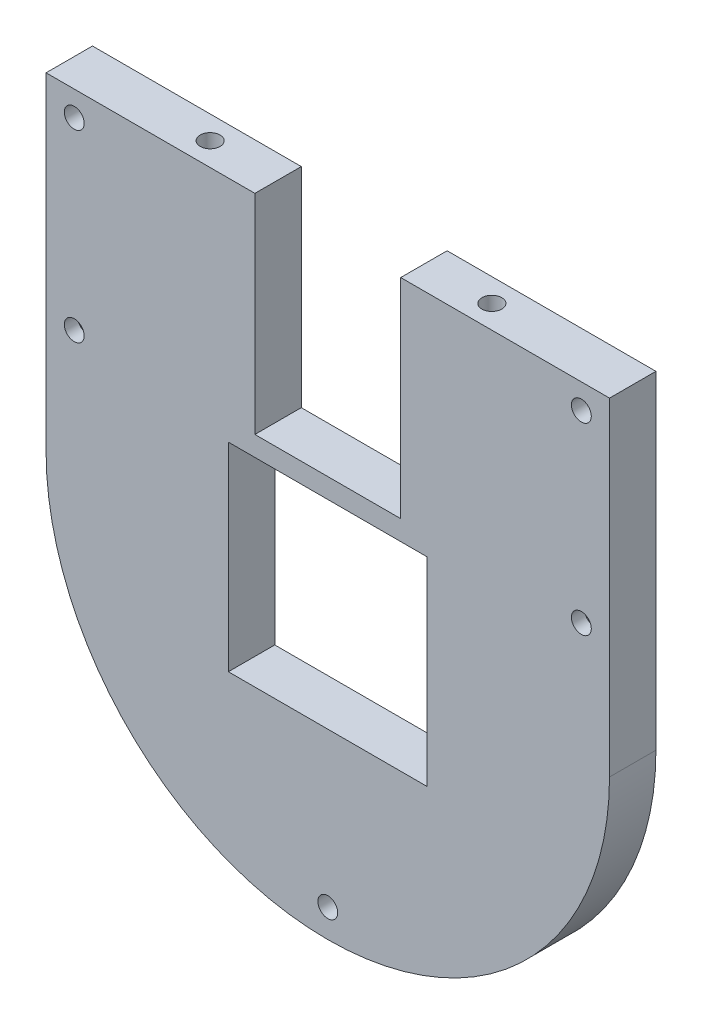
ISO-10303-21;
HEADER;
FILE_DESCRIPTION(('STEP AP214'),'2;1');
FILE_NAME('part.step','',(''),(''),'','','');
FILE_SCHEMA(('AUTOMOTIVE_DESIGN { 1 0 10303 214 1 1 1 1 }'));
ENDSEC;
DATA;
#1=APPLICATION_CONTEXT('core data for automotive mechanical design processes');
#2=APPLICATION_PROTOCOL_DEFINITION('international standard','automotive_design',2000,#1);
#3=PRODUCT_CONTEXT('',#1,'mechanical');
#4=PRODUCT('Part','Part','',(#3));
#5=PRODUCT_RELATED_PRODUCT_CATEGORY('part','',(#4));
#6=PRODUCT_DEFINITION_FORMATION('','',#4);
#7=PRODUCT_DEFINITION_CONTEXT('part definition',#1,'design');
#8=PRODUCT_DEFINITION('design','',#6,#7);
#9=PRODUCT_DEFINITION_SHAPE('','',#8);
#10=(LENGTH_UNIT() NAMED_UNIT(*) SI_UNIT(.MILLI.,.METRE.));
#11=(NAMED_UNIT(*) PLANE_ANGLE_UNIT() SI_UNIT($,.RADIAN.));
#12=(NAMED_UNIT(*) SI_UNIT($,.STERADIAN.) SOLID_ANGLE_UNIT());
#13=UNCERTAINTY_MEASURE_WITH_UNIT(LENGTH_MEASURE(1.E-05),#10,'distance_accuracy_value','');
#14=(GEOMETRIC_REPRESENTATION_CONTEXT(3) GLOBAL_UNCERTAINTY_ASSIGNED_CONTEXT((#13)) GLOBAL_UNIT_ASSIGNED_CONTEXT((#10,
#11,#12)) REPRESENTATION_CONTEXT('',''));
#15=CARTESIAN_POINT('',(0.,0.,0.));
#16=DIRECTION('',(0.,0.,1.));
#17=DIRECTION('',(1.,0.,0.));
#18=AXIS2_PLACEMENT_3D('',#15,#16,#17);
#19=CARTESIAN_POINT('',(0.,0.,7.));
#20=DIRECTION('',(0.,0.,-1.));
#21=DIRECTION('',(-1.,0.,0.));
#22=AXIS2_PLACEMENT_3D('',#19,#20,#21);
#23=PLANE('',#22);
#24=DIRECTION('',(-1.,0.,0.));
#25=VECTOR('',#24,1.);
#26=CARTESIAN_POINT('',(27.5,60.,7.));
#27=LINE('',#26,#25);
#28=CARTESIAN_POINT('',(57.5,60.,7.));
#29=VERTEX_POINT('',#28);
#30=CARTESIAN_POINT('',(27.5,60.,7.));
#31=VERTEX_POINT('',#30);
#32=EDGE_CURVE('E407',#29,#31,#27,.T.);
#33=ORIENTED_EDGE('',*,*,#32,.F.);
#34=DIRECTION('',(0.,1.,0.));
#35=VECTOR('',#34,1.);
#36=CARTESIAN_POINT('',(57.5,30.,7.));
#37=LINE('',#36,#35);
#38=CARTESIAN_POINT('',(57.5,30.,7.));
#39=VERTEX_POINT('',#38);
#40=EDGE_CURVE('E384',#39,#29,#37,.T.);
#41=ORIENTED_EDGE('',*,*,#40,.F.);
#42=DIRECTION('',(1.,0.,0.));
#43=VECTOR('',#42,1.);
#44=CARTESIAN_POINT('',(27.5,30.,7.));
#45=LINE('',#44,#43);
#46=CARTESIAN_POINT('',(27.5,30.,7.));
#47=VERTEX_POINT('',#46);
#48=EDGE_CURVE('E393',#47,#39,#45,.T.);
#49=ORIENTED_EDGE('',*,*,#48,.F.);
#50=DIRECTION('',(0.,-1.,0.));
#51=VECTOR('',#50,1.);
#52=CARTESIAN_POINT('',(27.5,30.,7.));
#53=LINE('',#52,#51);
#54=EDGE_CURVE('E411',#31,#47,#53,.T.);
#55=ORIENTED_EDGE('',*,*,#54,.F.);
#56=EDGE_LOOP('',(#33,#41,#49,#55));
#57=FACE_BOUND('',#56,.T.);
#58=CARTESIAN_POINT('',(80.75,90.75,7.));
#59=DIRECTION('',(0.,0.,-1.));
#60=DIRECTION('',(-1.,0.,0.));
#61=AXIS2_PLACEMENT_3D('',#58,#59,#60);
#62=CIRCLE('',#61,1.5);
#63=CARTESIAN_POINT('',(79.25,90.75,7.));
#64=VERTEX_POINT('',#63);
#65=EDGE_CURVE('E371',#64,#64,#62,.T.);
#66=ORIENTED_EDGE('',*,*,#65,.T.);
#67=EDGE_LOOP('',(#66));
#68=FACE_BOUND('',#67,.T.);
#69=CARTESIAN_POINT('',(4.24999999999999,90.75,7.));
#70=DIRECTION('',(0.,0.,-1.));
#71=DIRECTION('',(-1.,0.,0.));
#72=AXIS2_PLACEMENT_3D('',#69,#70,#71);
#73=CIRCLE('',#72,1.5);
#74=CARTESIAN_POINT('',(2.74999999999999,90.75,7.));
#75=VERTEX_POINT('',#74);
#76=EDGE_CURVE('E375',#75,#75,#73,.T.);
#77=ORIENTED_EDGE('',*,*,#76,.T.);
#78=EDGE_LOOP('',(#77));
#79=FACE_BOUND('',#78,.T.);
#80=CARTESIAN_POINT('',(4.24999999999999,63.,7.));
#81=DIRECTION('',(0.,0.,1.));
#82=DIRECTION('',(-1.,0.,0.));
#83=AXIS2_PLACEMENT_3D('',#80,#81,#82);
#84=CIRCLE('',#83,1.5);
#85=CARTESIAN_POINT('',(2.74999999999999,63.,7.));
#86=VERTEX_POINT('',#85);
#87=EDGE_CURVE('E250',#86,#86,#84,.T.);
#88=ORIENTED_EDGE('',*,*,#87,.F.);
#89=EDGE_LOOP('',(#88));
#90=FACE_BOUND('',#89,.T.);
#91=CARTESIAN_POINT('',(80.75,63.,7.));
#92=DIRECTION('',(0.,0.,1.));
#93=DIRECTION('',(1.,0.,0.));
#94=AXIS2_PLACEMENT_3D('',#91,#92,#93);
#95=CIRCLE('',#94,1.5);
#96=CARTESIAN_POINT('',(82.25,63.,7.));
#97=VERTEX_POINT('',#96);
#98=EDGE_CURVE('E344',#97,#97,#95,.T.);
#99=ORIENTED_EDGE('',*,*,#98,.F.);
#100=EDGE_LOOP('',(#99));
#101=FACE_BOUND('',#100,.T.);
#102=CARTESIAN_POINT('',(42.5,6.75,7.));
#103=DIRECTION('',(0.,0.,1.));
#104=DIRECTION('',(1.,0.,0.));
#105=AXIS2_PLACEMENT_3D('',#102,#103,#104);
#106=CIRCLE('',#105,1.5);
#107=CARTESIAN_POINT('',(44.,6.75,7.));
#108=VERTEX_POINT('',#107);
#109=EDGE_CURVE('E527',#108,#108,#106,.T.);
#110=ORIENTED_EDGE('',*,*,#109,.F.);
#111=EDGE_LOOP('',(#110));
#112=FACE_BOUND('',#111,.T.);
#113=DIRECTION('',(1.,0.,0.));
#114=VECTOR('',#113,1.);
#115=CARTESIAN_POINT('',(0.,94.5,7.));
#116=LINE('',#115,#114);
#117=CARTESIAN_POINT('',(0.,94.5,7.));
#118=VERTEX_POINT('',#117);
#119=CARTESIAN_POINT('',(31.5,94.5,7.));
#120=VERTEX_POINT('',#119);
#121=EDGE_CURVE('E62',#118,#120,#116,.T.);
#122=ORIENTED_EDGE('',*,*,#121,.F.);
#123=DIRECTION('',(0.,-1.,0.));
#124=VECTOR('',#123,1.);
#125=CARTESIAN_POINT('',(0.,0.,7.));
#126=LINE('',#125,#124);
#127=CARTESIAN_POINT('',(0.,45.,7.));
#128=VERTEX_POINT('',#127);
#129=EDGE_CURVE('E54',#118,#128,#126,.T.);
#130=ORIENTED_EDGE('',*,*,#129,.T.);
#131=CARTESIAN_POINT('',(42.5,45.,7.));
#132=DIRECTION('',(0.,0.,-1.));
#133=DIRECTION('',(-1.,0.,0.));
#134=AXIS2_PLACEMENT_3D('',#131,#132,#133);
#135=CIRCLE('',#134,42.5);
#136=CARTESIAN_POINT('',(85.,45.,7.));
#137=VERTEX_POINT('',#136);
#138=EDGE_CURVE('E357',#128,#137,#135,.F.);
#139=ORIENTED_EDGE('',*,*,#138,.T.);
#140=DIRECTION('',(0.,1.,0.));
#141=VECTOR('',#140,1.);
#142=CARTESIAN_POINT('',(85.,0.,7.));
#143=LINE('',#142,#141);
#144=CARTESIAN_POINT('',(85.,94.5,7.));
#145=VERTEX_POINT('',#144);
#146=EDGE_CURVE('E11',#137,#145,#143,.T.);
#147=ORIENTED_EDGE('',*,*,#146,.T.);
#148=DIRECTION('',(1.,0.,0.));
#149=VECTOR('',#148,1.);
#150=CARTESIAN_POINT('',(53.5,94.5,7.));
#151=LINE('',#150,#149);
#152=CARTESIAN_POINT('',(53.5,94.5,7.));
#153=VERTEX_POINT('',#152);
#154=EDGE_CURVE('E478',#153,#145,#151,.T.);
#155=ORIENTED_EDGE('',*,*,#154,.F.);
#156=DIRECTION('',(0.,-1.,0.));
#157=VECTOR('',#156,1.);
#158=CARTESIAN_POINT('',(53.5,0.,7.));
#159=LINE('',#158,#157);
#160=CARTESIAN_POINT('',(53.5,63.,7.));
#161=VERTEX_POINT('',#160);
#162=EDGE_CURVE('E516',#153,#161,#159,.T.);
#163=ORIENTED_EDGE('',*,*,#162,.T.);
#164=DIRECTION('',(-1.,0.,0.));
#165=VECTOR('',#164,1.);
#166=CARTESIAN_POINT('',(0.,63.,7.));
#167=LINE('',#166,#165);
#168=CARTESIAN_POINT('',(31.5,63.,7.));
#169=VERTEX_POINT('',#168);
#170=EDGE_CURVE('E522',#161,#169,#167,.T.);
#171=ORIENTED_EDGE('',*,*,#170,.T.);
#172=DIRECTION('',(0.,-1.,0.));
#173=VECTOR('',#172,1.);
#174=CARTESIAN_POINT('',(31.5,0.,7.));
#175=LINE('',#174,#173);
#176=EDGE_CURVE('E221',#120,#169,#175,.T.);
#177=ORIENTED_EDGE('',*,*,#176,.F.);
#178=EDGE_LOOP('',(#122,#130,#139,#147,#155,#163,#171,#177));
#179=FACE_BOUND('',#178,.T.);
#180=ADVANCED_FACE('F44',(#57,#68,#79,#90,#101,#112,#179),#23,.F.);
#181=CARTESIAN_POINT('',(0.,0.,0.));
#182=DIRECTION('',(0.,0.,-1.));
#183=DIRECTION('',(-1.,0.,0.));
#184=AXIS2_PLACEMENT_3D('',#181,#182,#183);
#185=PLANE('',#184);
#186=DIRECTION('',(0.5,0.866025403784438,0.));
#187=VECTOR('',#186,1.);
#188=CARTESIAN_POINT('',(77.34,63.,0.));
#189=LINE('',#188,#187);
#190=CARTESIAN_POINT('',(77.34,63.,0.));
#191=VERTEX_POINT('',#190);
#192=CARTESIAN_POINT('',(79.045,65.9531466269049,0.));
#193=VERTEX_POINT('',#192);
#194=EDGE_CURVE('E321',#191,#193,#189,.T.);
#195=ORIENTED_EDGE('',*,*,#194,.F.);
#196=DIRECTION('',(-0.499999999999997,0.86602540378444,0.));
#197=VECTOR('',#196,1.);
#198=CARTESIAN_POINT('',(79.045,60.0468533730951,0.));
#199=LINE('',#198,#197);
#200=CARTESIAN_POINT('',(79.045,60.0468533730951,0.));
#201=VERTEX_POINT('',#200);
#202=EDGE_CURVE('E260',#201,#191,#199,.T.);
#203=ORIENTED_EDGE('',*,*,#202,.F.);
#204=DIRECTION('',(-1.,0.,0.));
#205=VECTOR('',#204,1.);
#206=CARTESIAN_POINT('',(82.455,60.0468533730951,0.));
#207=LINE('',#206,#205);
#208=CARTESIAN_POINT('',(82.455,60.0468533730951,0.));
#209=VERTEX_POINT('',#208);
#210=EDGE_CURVE('E570',#209,#201,#207,.T.);
#211=ORIENTED_EDGE('',*,*,#210,.F.);
#212=DIRECTION('',(-0.500000000000003,-0.866025403784437,0.));
#213=VECTOR('',#212,1.);
#214=CARTESIAN_POINT('',(84.16,63.,0.));
#215=LINE('',#214,#213);
#216=CARTESIAN_POINT('',(84.16,63.,0.));
#217=VERTEX_POINT('',#216);
#218=EDGE_CURVE('E567',#217,#209,#215,.T.);
#219=ORIENTED_EDGE('',*,*,#218,.F.);
#220=DIRECTION('',(0.500000000000004,-0.866025403784436,0.));
#221=VECTOR('',#220,1.);
#222=CARTESIAN_POINT('',(82.455,65.9531466269049,0.));
#223=LINE('',#222,#221);
#224=CARTESIAN_POINT('',(82.455,65.9531466269049,0.));
#225=VERTEX_POINT('',#224);
#226=EDGE_CURVE('E563',#225,#217,#223,.T.);
#227=ORIENTED_EDGE('',*,*,#226,.F.);
#228=DIRECTION('',(1.,0.,0.));
#229=VECTOR('',#228,1.);
#230=CARTESIAN_POINT('',(79.045,65.9531466269049,0.));
#231=LINE('',#230,#229);
#232=EDGE_CURVE('E559',#193,#225,#231,.T.);
#233=ORIENTED_EDGE('',*,*,#232,.F.);
#234=EDGE_LOOP('',(#195,#203,#211,#219,#227,#233));
#235=FACE_BOUND('',#234,.T.);
#236=DIRECTION('',(0.500000000000004,0.866025403784436,0.));
#237=VECTOR('',#236,1.);
#238=CARTESIAN_POINT('',(2.54500000000001,65.9531466269049,0.));
#239=LINE('',#238,#237);
#240=CARTESIAN_POINT('',(0.840000000000021,63.,0.));
#241=VERTEX_POINT('',#240);
#242=CARTESIAN_POINT('',(2.54500000000001,65.9531466269049,0.));
#243=VERTEX_POINT('',#242);
#244=EDGE_CURVE('E318',#241,#243,#239,.T.);
#245=ORIENTED_EDGE('',*,*,#244,.F.);
#246=DIRECTION('',(-0.500000000000003,0.866025403784437,0.));
#247=VECTOR('',#246,1.);
#248=CARTESIAN_POINT('',(0.840000000000021,63.,0.));
#249=LINE('',#248,#247);
#250=CARTESIAN_POINT('',(2.54500000000003,60.0468533730951,0.));
#251=VERTEX_POINT('',#250);
#252=EDGE_CURVE('E297',#251,#241,#249,.T.);
#253=ORIENTED_EDGE('',*,*,#252,.F.);
#254=DIRECTION('',(-1.,0.,0.));
#255=VECTOR('',#254,1.);
#256=CARTESIAN_POINT('',(2.54500000000003,60.0468533730951,0.));
#257=LINE('',#256,#255);
#258=CARTESIAN_POINT('',(5.95499999999999,60.0468533730951,0.));
#259=VERTEX_POINT('',#258);
#260=EDGE_CURVE('E301',#259,#251,#257,.T.);
#261=ORIENTED_EDGE('',*,*,#260,.F.);
#262=DIRECTION('',(-0.499999999999997,-0.86602540378444,0.));
#263=VECTOR('',#262,1.);
#264=CARTESIAN_POINT('',(5.95499999999999,60.0468533730951,0.));
#265=LINE('',#264,#263);
#266=CARTESIAN_POINT('',(7.65999999999996,63.,0.));
#267=VERTEX_POINT('',#266);
#268=EDGE_CURVE('E306',#267,#259,#265,.T.);
#269=ORIENTED_EDGE('',*,*,#268,.F.);
#270=DIRECTION('',(0.5,-0.866025403784438,0.));
#271=VECTOR('',#270,1.);
#272=CARTESIAN_POINT('',(7.65999999999996,63.,0.));
#273=LINE('',#272,#271);
#274=CARTESIAN_POINT('',(5.95499999999997,65.9531466269049,0.));
#275=VERTEX_POINT('',#274);
#276=EDGE_CURVE('E310',#275,#267,#273,.T.);
#277=ORIENTED_EDGE('',*,*,#276,.F.);
#278=DIRECTION('',(1.,0.,0.));
#279=VECTOR('',#278,1.);
#280=CARTESIAN_POINT('',(5.95499999999997,65.9531466269049,0.));
#281=LINE('',#280,#279);
#282=EDGE_CURVE('E314',#243,#275,#281,.T.);
#283=ORIENTED_EDGE('',*,*,#282,.F.);
#284=EDGE_LOOP('',(#245,#253,#261,#269,#277,#283));
#285=FACE_BOUND('',#284,.T.);
#286=CARTESIAN_POINT('',(4.24999999999999,90.75,0.));
#287=DIRECTION('',(0.,0.,-1.));
#288=DIRECTION('',(1.,0.,0.));
#289=AXIS2_PLACEMENT_3D('',#286,#287,#288);
#290=CIRCLE('',#289,1.5);
#291=CARTESIAN_POINT('',(5.74999999999999,90.75,0.));
#292=VERTEX_POINT('',#291);
#293=EDGE_CURVE('E363',#292,#292,#290,.T.);
#294=ORIENTED_EDGE('',*,*,#293,.F.);
#295=EDGE_LOOP('',(#294));
#296=FACE_BOUND('',#295,.T.);
#297=CARTESIAN_POINT('',(80.75,90.75,0.));
#298=DIRECTION('',(0.,0.,-1.));
#299=DIRECTION('',(-1.,0.,0.));
#300=AXIS2_PLACEMENT_3D('',#297,#298,#299);
#301=CIRCLE('',#300,1.5);
#302=CARTESIAN_POINT('',(79.25,90.75,0.));
#303=VERTEX_POINT('',#302);
#304=EDGE_CURVE('E367',#303,#303,#301,.T.);
#305=ORIENTED_EDGE('',*,*,#304,.F.);
#306=EDGE_LOOP('',(#305));
#307=FACE_BOUND('',#306,.T.);
#308=DIRECTION('',(0.,1.,0.));
#309=VECTOR('',#308,1.);
#310=CARTESIAN_POINT('',(57.5,30.,0.));
#311=LINE('',#310,#309);
#312=CARTESIAN_POINT('',(57.5,30.,0.));
#313=VERTEX_POINT('',#312);
#314=CARTESIAN_POINT('',(57.5,60.,0.));
#315=VERTEX_POINT('',#314);
#316=EDGE_CURVE('E388',#313,#315,#311,.T.);
#317=ORIENTED_EDGE('',*,*,#316,.T.);
#318=DIRECTION('',(-1.,0.,0.));
#319=VECTOR('',#318,1.);
#320=CARTESIAN_POINT('',(27.5,60.,0.));
#321=LINE('',#320,#319);
#322=CARTESIAN_POINT('',(27.5,60.,0.));
#323=VERTEX_POINT('',#322);
#324=EDGE_CURVE('E392',#315,#323,#321,.T.);
#325=ORIENTED_EDGE('',*,*,#324,.T.);
#326=DIRECTION('',(0.,-1.,0.));
#327=VECTOR('',#326,1.);
#328=CARTESIAN_POINT('',(27.5,30.,0.));
#329=LINE('',#328,#327);
#330=CARTESIAN_POINT('',(27.5,30.,0.));
#331=VERTEX_POINT('',#330);
#332=EDGE_CURVE('E397',#323,#331,#329,.T.);
#333=ORIENTED_EDGE('',*,*,#332,.T.);
#334=DIRECTION('',(1.,0.,0.));
#335=VECTOR('',#334,1.);
#336=CARTESIAN_POINT('',(27.5,30.,0.));
#337=LINE('',#336,#335);
#338=EDGE_CURVE('E401',#331,#313,#337,.T.);
#339=ORIENTED_EDGE('',*,*,#338,.T.);
#340=EDGE_LOOP('',(#317,#325,#333,#339));
#341=FACE_BOUND('',#340,.T.);
#342=DIRECTION('',(0.,-1.,0.));
#343=VECTOR('',#342,1.);
#344=CARTESIAN_POINT('',(0.,0.,0.));
#345=LINE('',#344,#343);
#346=CARTESIAN_POINT('',(0.,94.5,0.));
#347=VERTEX_POINT('',#346);
#348=CARTESIAN_POINT('',(0.,45.,0.));
#349=VERTEX_POINT('',#348);
#350=EDGE_CURVE('E233',#347,#349,#345,.T.);
#351=ORIENTED_EDGE('',*,*,#350,.F.);
#352=DIRECTION('',(-1.,0.,0.));
#353=VECTOR('',#352,1.);
#354=CARTESIAN_POINT('',(0.,94.5,0.));
#355=LINE('',#354,#353);
#356=CARTESIAN_POINT('',(31.5,94.5,0.));
#357=VERTEX_POINT('',#356);
#358=EDGE_CURVE('E209',#357,#347,#355,.T.);
#359=ORIENTED_EDGE('',*,*,#358,.F.);
#360=DIRECTION('',(0.,-1.,0.));
#361=VECTOR('',#360,1.);
#362=CARTESIAN_POINT('',(31.5,0.,0.));
#363=LINE('',#362,#361);
#364=CARTESIAN_POINT('',(31.5,63.,0.));
#365=VERTEX_POINT('',#364);
#366=EDGE_CURVE('E502',#357,#365,#363,.T.);
#367=ORIENTED_EDGE('',*,*,#366,.T.);
#368=DIRECTION('',(-1.,0.,0.));
#369=VECTOR('',#368,1.);
#370=CARTESIAN_POINT('',(0.,63.,0.));
#371=LINE('',#370,#369);
#372=CARTESIAN_POINT('',(53.5,63.,0.));
#373=VERTEX_POINT('',#372);
#374=EDGE_CURVE('E507',#373,#365,#371,.T.);
#375=ORIENTED_EDGE('',*,*,#374,.F.);
#376=DIRECTION('',(0.,-1.,0.));
#377=VECTOR('',#376,1.);
#378=CARTESIAN_POINT('',(53.5,0.,0.));
#379=LINE('',#378,#377);
#380=CARTESIAN_POINT('',(53.5,94.5,0.));
#381=VERTEX_POINT('',#380);
#382=EDGE_CURVE('E487',#381,#373,#379,.T.);
#383=ORIENTED_EDGE('',*,*,#382,.F.);
#384=DIRECTION('',(-1.,0.,0.));
#385=VECTOR('',#384,1.);
#386=CARTESIAN_POINT('',(53.5,94.5,0.));
#387=LINE('',#386,#385);
#388=CARTESIAN_POINT('',(85.,94.5,0.));
#389=VERTEX_POINT('',#388);
#390=EDGE_CURVE('E70',#389,#381,#387,.T.);
#391=ORIENTED_EDGE('',*,*,#390,.F.);
#392=DIRECTION('',(0.,1.,0.));
#393=VECTOR('',#392,1.);
#394=CARTESIAN_POINT('',(85.,0.,0.));
#395=LINE('',#394,#393);
#396=CARTESIAN_POINT('',(85.,45.,0.));
#397=VERTEX_POINT('',#396);
#398=EDGE_CURVE('E229',#397,#389,#395,.T.);
#399=ORIENTED_EDGE('',*,*,#398,.F.);
#400=CARTESIAN_POINT('',(42.5,45.,0.));
#401=DIRECTION('',(0.,0.,1.));
#402=DIRECTION('',(-1.,0.,0.));
#403=AXIS2_PLACEMENT_3D('',#400,#401,#402);
#404=CIRCLE('',#403,42.5);
#405=EDGE_CURVE('E348',#349,#397,#404,.T.);
#406=ORIENTED_EDGE('',*,*,#405,.F.);
#407=EDGE_LOOP('',(#351,#359,#367,#375,#383,#391,#399,#406));
#408=FACE_BOUND('',#407,.T.);
#409=ADVANCED_FACE('F444',(#235,#285,#296,#307,#341,#408),#185,.T.);
#410=CARTESIAN_POINT('',(85.,0.,7.));
#411=DIRECTION('',(-1.,0.,0.));
#412=DIRECTION('',(0.,0.,1.));
#413=AXIS2_PLACEMENT_3D('',#410,#411,#412);
#414=PLANE('',#413);
#415=DIRECTION('',(0.,0.,-1.));
#416=VECTOR('',#415,1.);
#417=CARTESIAN_POINT('',(85.,94.5,0.));
#418=LINE('',#417,#416);
#419=EDGE_CURVE('E475',#145,#389,#418,.T.);
#420=ORIENTED_EDGE('',*,*,#419,.F.);
#421=ORIENTED_EDGE('',*,*,#146,.F.);
#422=DIRECTION('',(0.,0.,-1.));
#423=VECTOR('',#422,1.);
#424=CARTESIAN_POINT('',(85.,45.,10.));
#425=LINE('',#424,#423);
#426=EDGE_CURVE('E354',#137,#397,#425,.T.);
#427=ORIENTED_EDGE('',*,*,#426,.T.);
#428=ORIENTED_EDGE('',*,*,#398,.T.);
#429=EDGE_LOOP('',(#420,#421,#427,#428));
#430=FACE_BOUND('',#429,.T.);
#431=ADVANCED_FACE('F464',(#430),#414,.F.);
#432=CARTESIAN_POINT('',(0.,0.,7.));
#433=DIRECTION('',(1.,0.,0.));
#434=DIRECTION('',(0.,0.,-1.));
#435=AXIS2_PLACEMENT_3D('',#432,#433,#434);
#436=PLANE('',#435);
#437=DIRECTION('',(0.,0.,1.));
#438=VECTOR('',#437,1.);
#439=CARTESIAN_POINT('',(0.,94.5,0.));
#440=LINE('',#439,#438);
#441=EDGE_CURVE('E206',#347,#118,#440,.T.);
#442=ORIENTED_EDGE('',*,*,#441,.F.);
#443=ORIENTED_EDGE('',*,*,#350,.T.);
#444=DIRECTION('',(0.,0.,-1.));
#445=VECTOR('',#444,1.);
#446=CARTESIAN_POINT('',(0.,45.,10.));
#447=LINE('',#446,#445);
#448=EDGE_CURVE('E227',#128,#349,#447,.T.);
#449=ORIENTED_EDGE('',*,*,#448,.F.);
#450=ORIENTED_EDGE('',*,*,#129,.F.);
#451=EDGE_LOOP('',(#442,#443,#449,#450));
#452=FACE_BOUND('',#451,.T.);
#453=ADVANCED_FACE('F46',(#452),#436,.F.);
#454=CARTESIAN_POINT('',(31.5,0.,10.));
#455=DIRECTION('',(1.,0.,0.));
#456=DIRECTION('',(0.,1.,0.));
#457=AXIS2_PLACEMENT_3D('',#454,#455,#456);
#458=PLANE('',#457);
#459=ORIENTED_EDGE('',*,*,#366,.F.);
#460=DIRECTION('',(0.,0.,-1.));
#461=VECTOR('',#460,1.);
#462=CARTESIAN_POINT('',(31.5,94.5,0.));
#463=LINE('',#462,#461);
#464=EDGE_CURVE('E223',#120,#357,#463,.T.);
#465=ORIENTED_EDGE('',*,*,#464,.F.);
#466=ORIENTED_EDGE('',*,*,#176,.T.);
#467=DIRECTION('',(0.,0.,-1.));
#468=VECTOR('',#467,1.);
#469=CARTESIAN_POINT('',(31.5,63.,10.));
#470=LINE('',#469,#468);
#471=EDGE_CURVE('E512',#169,#365,#470,.T.);
#472=ORIENTED_EDGE('',*,*,#471,.T.);
#473=EDGE_LOOP('',(#459,#465,#466,#472));
#474=FACE_BOUND('',#473,.T.);
#475=ADVANCED_FACE('F472',(#474),#458,.T.);
#476=CARTESIAN_POINT('',(53.5,0.,10.));
#477=DIRECTION('',(1.,0.,0.));
#478=DIRECTION('',(0.,0.,-1.));
#479=AXIS2_PLACEMENT_3D('',#476,#477,#478);
#480=PLANE('',#479);
#481=DIRECTION('',(0.,0.,1.));
#482=VECTOR('',#481,1.);
#483=CARTESIAN_POINT('',(53.5,94.5,0.));
#484=LINE('',#483,#482);
#485=EDGE_CURVE('E495',#381,#153,#484,.T.);
#486=ORIENTED_EDGE('',*,*,#485,.F.);
#487=ORIENTED_EDGE('',*,*,#382,.T.);
#488=DIRECTION('',(0.,0.,-1.));
#489=VECTOR('',#488,1.);
#490=CARTESIAN_POINT('',(53.5,63.,10.));
#491=LINE('',#490,#489);
#492=EDGE_CURVE('E511',#161,#373,#491,.T.);
#493=ORIENTED_EDGE('',*,*,#492,.F.);
#494=ORIENTED_EDGE('',*,*,#162,.F.);
#495=EDGE_LOOP('',(#486,#487,#493,#494));
#496=FACE_BOUND('',#495,.T.);
#497=ADVANCED_FACE('F455',(#496),#480,.F.);
#498=CARTESIAN_POINT('',(80.75,63.,-3.));
#499=DIRECTION('',(0.,0.,1.));
#500=DIRECTION('',(1.,0.,0.));
#501=AXIS2_PLACEMENT_3D('',#498,#499,#500);
#502=CYLINDRICAL_SURFACE('',#501,1.5);
#503=ORIENTED_EDGE('',*,*,#98,.T.);
#504=EDGE_LOOP('',(#503));
#505=FACE_BOUND('',#504,.T.);
#506=CARTESIAN_POINT('',(80.75,63.,5.));
#507=DIRECTION('',(0.,0.,-1.));
#508=DIRECTION('',(-1.,0.,0.));
#509=AXIS2_PLACEMENT_3D('',#506,#507,#508);
#510=CIRCLE('',#509,1.5);
#511=CARTESIAN_POINT('',(79.25,63.,5.));
#512=VERTEX_POINT('',#511);
#513=EDGE_CURVE('E241',#512,#512,#510,.F.);
#514=ORIENTED_EDGE('',*,*,#513,.F.);
#515=EDGE_LOOP('',(#514));
#516=FACE_BOUND('',#515,.T.);
#517=ADVANCED_FACE('F448',(#505,#516),#502,.F.);
#518=CARTESIAN_POINT('',(57.5,30.,0.));
#519=DIRECTION('',(1.,0.,0.));
#520=DIRECTION('',(0.,0.,-1.));
#521=AXIS2_PLACEMENT_3D('',#518,#519,#520);
#522=PLANE('',#521);
#523=ORIENTED_EDGE('',*,*,#40,.T.);
#524=DIRECTION('',(0.,0.,1.));
#525=VECTOR('',#524,1.);
#526=CARTESIAN_POINT('',(57.5,60.,0.));
#527=LINE('',#526,#525);
#528=EDGE_CURVE('E236',#315,#29,#527,.T.);
#529=ORIENTED_EDGE('',*,*,#528,.F.);
#530=ORIENTED_EDGE('',*,*,#316,.F.);
#531=DIRECTION('',(0.,0.,1.));
#532=VECTOR('',#531,1.);
#533=CARTESIAN_POINT('',(57.5,30.,0.));
#534=LINE('',#533,#532);
#535=EDGE_CURVE('E240',#313,#39,#534,.T.);
#536=ORIENTED_EDGE('',*,*,#535,.T.);
#537=EDGE_LOOP('',(#523,#529,#530,#536));
#538=FACE_BOUND('',#537,.T.);
#539=ADVANCED_FACE('F446',(#538),#522,.F.);
#540=CARTESIAN_POINT('',(27.5,30.,0.));
#541=DIRECTION('',(0.,-1.,0.));
#542=DIRECTION('',(0.,0.,-1.));
#543=AXIS2_PLACEMENT_3D('',#540,#541,#542);
#544=PLANE('',#543);
#545=ORIENTED_EDGE('',*,*,#48,.T.);
#546=ORIENTED_EDGE('',*,*,#535,.F.);
#547=ORIENTED_EDGE('',*,*,#338,.F.);
#548=DIRECTION('',(0.,0.,1.));
#549=VECTOR('',#548,1.);
#550=CARTESIAN_POINT('',(27.5,30.,0.));
#551=LINE('',#550,#549);
#552=EDGE_CURVE('E420',#331,#47,#551,.T.);
#553=ORIENTED_EDGE('',*,*,#552,.T.);
#554=EDGE_LOOP('',(#545,#546,#547,#553));
#555=FACE_BOUND('',#554,.T.);
#556=ADVANCED_FACE('F442',(#555),#544,.F.);
#557=CARTESIAN_POINT('',(27.5,30.,0.));
#558=DIRECTION('',(-1.,0.,0.));
#559=DIRECTION('',(0.,0.,1.));
#560=AXIS2_PLACEMENT_3D('',#557,#558,#559);
#561=PLANE('',#560);
#562=ORIENTED_EDGE('',*,*,#54,.T.);
#563=ORIENTED_EDGE('',*,*,#552,.F.);
#564=ORIENTED_EDGE('',*,*,#332,.F.);
#565=DIRECTION('',(0.,0.,1.));
#566=VECTOR('',#565,1.);
#567=CARTESIAN_POINT('',(27.5,60.,0.));
#568=LINE('',#567,#566);
#569=EDGE_CURVE('E422',#323,#31,#568,.T.);
#570=ORIENTED_EDGE('',*,*,#569,.T.);
#571=EDGE_LOOP('',(#562,#563,#564,#570));
#572=FACE_BOUND('',#571,.T.);
#573=ADVANCED_FACE('F439',(#572),#561,.F.);
#574=CARTESIAN_POINT('',(27.5,60.,0.));
#575=DIRECTION('',(0.,1.,0.));
#576=DIRECTION('',(0.,0.,1.));
#577=AXIS2_PLACEMENT_3D('',#574,#575,#576);
#578=PLANE('',#577);
#579=ORIENTED_EDGE('',*,*,#32,.T.);
#580=ORIENTED_EDGE('',*,*,#569,.F.);
#581=ORIENTED_EDGE('',*,*,#324,.F.);
#582=ORIENTED_EDGE('',*,*,#528,.T.);
#583=EDGE_LOOP('',(#579,#580,#581,#582));
#584=FACE_BOUND('',#583,.T.);
#585=ADVANCED_FACE('F431',(#584),#578,.F.);
#586=CARTESIAN_POINT('',(80.75,90.75,8.));
#587=DIRECTION('',(0.,0.,-1.));
#588=DIRECTION('',(-1.,0.,0.));
#589=AXIS2_PLACEMENT_3D('',#586,#587,#588);
#590=CYLINDRICAL_SURFACE('',#589,1.5);
#591=ORIENTED_EDGE('',*,*,#304,.T.);
#592=EDGE_LOOP('',(#591));
#593=FACE_BOUND('',#592,.T.);
#594=ORIENTED_EDGE('',*,*,#65,.F.);
#595=EDGE_LOOP('',(#594));
#596=FACE_BOUND('',#595,.T.);
#597=ADVANCED_FACE('F649',(#593,#596),#590,.F.);
#598=CARTESIAN_POINT('',(4.24999999999999,90.75,8.));
#599=DIRECTION('',(0.,0.,-1.));
#600=DIRECTION('',(-1.,0.,0.));
#601=AXIS2_PLACEMENT_3D('',#598,#599,#600);
#602=CYLINDRICAL_SURFACE('',#601,1.5);
#603=ORIENTED_EDGE('',*,*,#293,.T.);
#604=EDGE_LOOP('',(#603));
#605=FACE_BOUND('',#604,.T.);
#606=ORIENTED_EDGE('',*,*,#76,.F.);
#607=EDGE_LOOP('',(#606));
#608=FACE_BOUND('',#607,.T.);
#609=ADVANCED_FACE('F646',(#605,#608),#602,.F.);
#610=CARTESIAN_POINT('',(42.5,45.,10.));
#611=DIRECTION('',(0.,0.,-1.));
#612=DIRECTION('',(-1.,0.,0.));
#613=AXIS2_PLACEMENT_3D('',#610,#611,#612);
#614=CYLINDRICAL_SURFACE('',#613,42.5);
#615=ORIENTED_EDGE('',*,*,#448,.T.);
#616=ORIENTED_EDGE('',*,*,#405,.T.);
#617=ORIENTED_EDGE('',*,*,#426,.F.);
#618=ORIENTED_EDGE('',*,*,#138,.F.);
#619=EDGE_LOOP('',(#615,#616,#617,#618));
#620=FACE_BOUND('',#619,.T.);
#621=ADVANCED_FACE('F483',(#620),#614,.T.);
#622=CARTESIAN_POINT('',(4.24999999999999,63.,-3.));
#623=DIRECTION('',(0.,0.,1.));
#624=DIRECTION('',(1.,0.,0.));
#625=AXIS2_PLACEMENT_3D('',#622,#623,#624);
#626=CYLINDRICAL_SURFACE('',#625,1.5);
#627=CARTESIAN_POINT('',(4.24999999999999,63.,5.));
#628=DIRECTION('',(0.,0.,1.));
#629=DIRECTION('',(1.,0.,0.));
#630=AXIS2_PLACEMENT_3D('',#627,#628,#629);
#631=CIRCLE('',#630,1.5);
#632=CARTESIAN_POINT('',(5.74999999999999,63.,5.));
#633=VERTEX_POINT('',#632);
#634=EDGE_CURVE('E48',#633,#633,#631,.F.);
#635=ORIENTED_EDGE('',*,*,#634,.T.);
#636=EDGE_LOOP('',(#635));
#637=FACE_BOUND('',#636,.T.);
#638=ORIENTED_EDGE('',*,*,#87,.T.);
#639=EDGE_LOOP('',(#638));
#640=FACE_BOUND('',#639,.T.);
#641=ADVANCED_FACE('F640',(#637,#640),#626,.F.);
#642=CARTESIAN_POINT('',(0.,0.,5.));
#643=DIRECTION('',(0.,0.,-1.));
#644=DIRECTION('',(-1.,0.,0.));
#645=AXIS2_PLACEMENT_3D('',#642,#643,#644);
#646=PLANE('',#645);
#647=DIRECTION('',(0.5,0.866025403784438,0.));
#648=VECTOR('',#647,1.);
#649=CARTESIAN_POINT('',(77.34,63.,5.));
#650=LINE('',#649,#648);
#651=CARTESIAN_POINT('',(77.34,63.,5.));
#652=VERTEX_POINT('',#651);
#653=CARTESIAN_POINT('',(79.045,65.9531466269049,5.));
#654=VERTEX_POINT('',#653);
#655=EDGE_CURVE('E534',#652,#654,#650,.T.);
#656=ORIENTED_EDGE('',*,*,#655,.T.);
#657=DIRECTION('',(1.,0.,0.));
#658=VECTOR('',#657,1.);
#659=CARTESIAN_POINT('',(79.045,65.9531466269049,5.));
#660=LINE('',#659,#658);
#661=CARTESIAN_POINT('',(82.455,65.9531466269049,5.));
#662=VERTEX_POINT('',#661);
#663=EDGE_CURVE('E538',#654,#662,#660,.T.);
#664=ORIENTED_EDGE('',*,*,#663,.T.);
#665=DIRECTION('',(0.500000000000004,-0.866025403784436,0.));
#666=VECTOR('',#665,1.);
#667=CARTESIAN_POINT('',(82.455,65.9531466269049,5.));
#668=LINE('',#667,#666);
#669=CARTESIAN_POINT('',(84.16,63.,5.));
#670=VERTEX_POINT('',#669);
#671=EDGE_CURVE('E542',#662,#670,#668,.T.);
#672=ORIENTED_EDGE('',*,*,#671,.T.);
#673=DIRECTION('',(-0.500000000000003,-0.866025403784437,0.));
#674=VECTOR('',#673,1.);
#675=CARTESIAN_POINT('',(84.16,63.,5.));
#676=LINE('',#675,#674);
#677=CARTESIAN_POINT('',(82.455,60.0468533730951,5.));
#678=VERTEX_POINT('',#677);
#679=EDGE_CURVE('E546',#670,#678,#676,.T.);
#680=ORIENTED_EDGE('',*,*,#679,.T.);
#681=DIRECTION('',(-1.,0.,0.));
#682=VECTOR('',#681,1.);
#683=CARTESIAN_POINT('',(82.455,60.0468533730951,5.));
#684=LINE('',#683,#682);
#685=CARTESIAN_POINT('',(79.045,60.0468533730951,5.));
#686=VERTEX_POINT('',#685);
#687=EDGE_CURVE('E550',#678,#686,#684,.T.);
#688=ORIENTED_EDGE('',*,*,#687,.T.);
#689=DIRECTION('',(-0.499999999999997,0.86602540378444,0.));
#690=VECTOR('',#689,1.);
#691=CARTESIAN_POINT('',(79.045,60.0468533730951,5.));
#692=LINE('',#691,#690);
#693=EDGE_CURVE('E275',#686,#652,#692,.T.);
#694=ORIENTED_EDGE('',*,*,#693,.T.);
#695=EDGE_LOOP('',(#656,#664,#672,#680,#688,#694));
#696=FACE_BOUND('',#695,.T.);
#697=ORIENTED_EDGE('',*,*,#513,.T.);
#698=EDGE_LOOP('',(#697));
#699=FACE_BOUND('',#698,.T.);
#700=ADVANCED_FACE('F590',(#696,#699),#646,.T.);
#701=CARTESIAN_POINT('',(77.34,63.,5.));
#702=DIRECTION('',(-0.866025403784438,0.5,0.));
#703=DIRECTION('',(-0.5,-0.866025403784439,0.));
#704=AXIS2_PLACEMENT_3D('',#701,#702,#703);
#705=PLANE('',#704);
#706=ORIENTED_EDGE('',*,*,#194,.T.);
#707=DIRECTION('',(0.,0.,-1.));
#708=VECTOR('',#707,1.);
#709=CARTESIAN_POINT('',(79.045,65.9531466269049,5.));
#710=LINE('',#709,#708);
#711=EDGE_CURVE('E271',#654,#193,#710,.T.);
#712=ORIENTED_EDGE('',*,*,#711,.F.);
#713=ORIENTED_EDGE('',*,*,#655,.F.);
#714=DIRECTION('',(0.,0.,-1.));
#715=VECTOR('',#714,1.);
#716=CARTESIAN_POINT('',(77.34,63.,5.));
#717=LINE('',#716,#715);
#718=EDGE_CURVE('E244',#652,#191,#717,.T.);
#719=ORIENTED_EDGE('',*,*,#718,.T.);
#720=EDGE_LOOP('',(#706,#712,#713,#719));
#721=FACE_BOUND('',#720,.T.);
#722=ADVANCED_FACE('F584',(#721),#705,.F.);
#723=CARTESIAN_POINT('',(79.045,60.0468533730951,5.));
#724=DIRECTION('',(-0.86602540378444,-0.499999999999997,0.));
#725=DIRECTION('',(0.499999999999997,-0.86602540378444,0.));
#726=AXIS2_PLACEMENT_3D('',#723,#724,#725);
#727=PLANE('',#726);
#728=ORIENTED_EDGE('',*,*,#202,.T.);
#729=ORIENTED_EDGE('',*,*,#718,.F.);
#730=ORIENTED_EDGE('',*,*,#693,.F.);
#731=DIRECTION('',(0.,0.,-1.));
#732=VECTOR('',#731,1.);
#733=CARTESIAN_POINT('',(79.045,60.0468533730951,5.));
#734=LINE('',#733,#732);
#735=EDGE_CURVE('E251',#686,#201,#734,.T.);
#736=ORIENTED_EDGE('',*,*,#735,.T.);
#737=EDGE_LOOP('',(#728,#729,#730,#736));
#738=FACE_BOUND('',#737,.T.);
#739=ADVANCED_FACE('F579',(#738),#727,.F.);
#740=CARTESIAN_POINT('',(82.455,60.0468533730951,5.));
#741=DIRECTION('',(0.,-1.,0.));
#742=DIRECTION('',(0.,0.,-1.));
#743=AXIS2_PLACEMENT_3D('',#740,#741,#742);
#744=PLANE('',#743);
#745=ORIENTED_EDGE('',*,*,#210,.T.);
#746=ORIENTED_EDGE('',*,*,#735,.F.);
#747=ORIENTED_EDGE('',*,*,#687,.F.);
#748=DIRECTION('',(0.,0.,-1.));
#749=VECTOR('',#748,1.);
#750=CARTESIAN_POINT('',(82.455,60.0468533730951,5.));
#751=LINE('',#750,#749);
#752=EDGE_CURVE('E257',#678,#209,#751,.T.);
#753=ORIENTED_EDGE('',*,*,#752,.T.);
#754=EDGE_LOOP('',(#745,#746,#747,#753));
#755=FACE_BOUND('',#754,.T.);
#756=ADVANCED_FACE('F593',(#755),#744,.F.);
#757=CARTESIAN_POINT('',(84.16,63.,5.));
#758=DIRECTION('',(0.866025403784437,-0.500000000000003,0.));
#759=DIRECTION('',(0.500000000000003,0.866025403784437,0.));
#760=AXIS2_PLACEMENT_3D('',#757,#758,#759);
#761=PLANE('',#760);
#762=ORIENTED_EDGE('',*,*,#218,.T.);
#763=ORIENTED_EDGE('',*,*,#752,.F.);
#764=ORIENTED_EDGE('',*,*,#679,.F.);
#765=DIRECTION('',(0.,0.,-1.));
#766=VECTOR('',#765,1.);
#767=CARTESIAN_POINT('',(84.16,63.,5.));
#768=LINE('',#767,#766);
#769=EDGE_CURVE('E265',#670,#217,#768,.T.);
#770=ORIENTED_EDGE('',*,*,#769,.T.);
#771=EDGE_LOOP('',(#762,#763,#764,#770));
#772=FACE_BOUND('',#771,.T.);
#773=ADVANCED_FACE('F596',(#772),#761,.F.);
#774=CARTESIAN_POINT('',(82.455,65.9531466269049,5.));
#775=DIRECTION('',(0.866025403784436,0.500000000000004,0.));
#776=DIRECTION('',(-0.500000000000004,0.866025403784437,0.));
#777=AXIS2_PLACEMENT_3D('',#774,#775,#776);
#778=PLANE('',#777);
#779=ORIENTED_EDGE('',*,*,#226,.T.);
#780=ORIENTED_EDGE('',*,*,#769,.F.);
#781=ORIENTED_EDGE('',*,*,#671,.F.);
#782=DIRECTION('',(0.,0.,-1.));
#783=VECTOR('',#782,1.);
#784=CARTESIAN_POINT('',(82.455,65.9531466269049,5.));
#785=LINE('',#784,#783);
#786=EDGE_CURVE('E268',#662,#225,#785,.T.);
#787=ORIENTED_EDGE('',*,*,#786,.T.);
#788=EDGE_LOOP('',(#779,#780,#781,#787));
#789=FACE_BOUND('',#788,.T.);
#790=ADVANCED_FACE('F598',(#789),#778,.F.);
#791=CARTESIAN_POINT('',(79.045,65.9531466269049,5.));
#792=DIRECTION('',(0.,1.,0.));
#793=DIRECTION('',(0.,0.,1.));
#794=AXIS2_PLACEMENT_3D('',#791,#792,#793);
#795=PLANE('',#794);
#796=ORIENTED_EDGE('',*,*,#232,.T.);
#797=ORIENTED_EDGE('',*,*,#786,.F.);
#798=ORIENTED_EDGE('',*,*,#663,.F.);
#799=ORIENTED_EDGE('',*,*,#711,.T.);
#800=EDGE_LOOP('',(#796,#797,#798,#799));
#801=FACE_BOUND('',#800,.T.);
#802=ADVANCED_FACE('F587',(#801),#795,.F.);
#803=CARTESIAN_POINT('',(0.,0.,5.));
#804=DIRECTION('',(0.,0.,1.));
#805=DIRECTION('',(1.,0.,0.));
#806=AXIS2_PLACEMENT_3D('',#803,#804,#805);
#807=PLANE('',#806);
#808=DIRECTION('',(0.500000000000004,0.866025403784436,0.));
#809=VECTOR('',#808,1.);
#810=CARTESIAN_POINT('',(2.54500000000001,65.9531466269049,5.));
#811=LINE('',#810,#809);
#812=CARTESIAN_POINT('',(0.840000000000021,63.,5.));
#813=VERTEX_POINT('',#812);
#814=CARTESIAN_POINT('',(2.54500000000001,65.9531466269049,5.));
#815=VERTEX_POINT('',#814);
#816=EDGE_CURVE('E302',#813,#815,#811,.T.);
#817=ORIENTED_EDGE('',*,*,#816,.T.);
#818=DIRECTION('',(1.,0.,0.));
#819=VECTOR('',#818,1.);
#820=CARTESIAN_POINT('',(5.95499999999997,65.9531466269049,5.));
#821=LINE('',#820,#819);
#822=CARTESIAN_POINT('',(5.95499999999997,65.9531466269049,5.));
#823=VERTEX_POINT('',#822);
#824=EDGE_CURVE('E337',#815,#823,#821,.T.);
#825=ORIENTED_EDGE('',*,*,#824,.T.);
#826=DIRECTION('',(0.5,-0.866025403784438,0.));
#827=VECTOR('',#826,1.);
#828=CARTESIAN_POINT('',(7.65999999999996,63.,5.));
#829=LINE('',#828,#827);
#830=CARTESIAN_POINT('',(7.65999999999996,63.,5.));
#831=VERTEX_POINT('',#830);
#832=EDGE_CURVE('E333',#823,#831,#829,.T.);
#833=ORIENTED_EDGE('',*,*,#832,.T.);
#834=DIRECTION('',(-0.499999999999997,-0.86602540378444,0.));
#835=VECTOR('',#834,1.);
#836=CARTESIAN_POINT('',(5.95499999999999,60.0468533730951,5.));
#837=LINE('',#836,#835);
#838=CARTESIAN_POINT('',(5.95499999999999,60.0468533730951,5.));
#839=VERTEX_POINT('',#838);
#840=EDGE_CURVE('E329',#831,#839,#837,.T.);
#841=ORIENTED_EDGE('',*,*,#840,.T.);
#842=DIRECTION('',(-1.,0.,0.));
#843=VECTOR('',#842,1.);
#844=CARTESIAN_POINT('',(2.54500000000003,60.0468533730951,5.));
#845=LINE('',#844,#843);
#846=CARTESIAN_POINT('',(2.54500000000003,60.0468533730951,5.));
#847=VERTEX_POINT('',#846);
#848=EDGE_CURVE('E325',#839,#847,#845,.T.);
#849=ORIENTED_EDGE('',*,*,#848,.T.);
#850=DIRECTION('',(-0.500000000000003,0.866025403784437,0.));
#851=VECTOR('',#850,1.);
#852=CARTESIAN_POINT('',(0.840000000000021,63.,5.));
#853=LINE('',#852,#851);
#854=EDGE_CURVE('E280',#847,#813,#853,.T.);
#855=ORIENTED_EDGE('',*,*,#854,.T.);
#856=EDGE_LOOP('',(#817,#825,#833,#841,#849,#855));
#857=FACE_BOUND('',#856,.T.);
#858=ORIENTED_EDGE('',*,*,#634,.F.);
#859=EDGE_LOOP('',(#858));
#860=FACE_BOUND('',#859,.T.);
#861=ADVANCED_FACE('F605',(#857,#860),#807,.F.);
#862=CARTESIAN_POINT('',(2.54500000000001,65.9531466269049,5.));
#863=DIRECTION('',(-0.866025403784436,0.500000000000004,0.));
#864=DIRECTION('',(-0.500000000000004,-0.866025403784437,0.));
#865=AXIS2_PLACEMENT_3D('',#862,#863,#864);
#866=PLANE('',#865);
#867=ORIENTED_EDGE('',*,*,#244,.T.);
#868=DIRECTION('',(0.,0.,-1.));
#869=VECTOR('',#868,1.);
#870=CARTESIAN_POINT('',(2.54500000000001,65.9531466269049,5.));
#871=LINE('',#870,#869);
#872=EDGE_CURVE('E276',#815,#243,#871,.T.);
#873=ORIENTED_EDGE('',*,*,#872,.F.);
#874=ORIENTED_EDGE('',*,*,#816,.F.);
#875=DIRECTION('',(0.,0.,-1.));
#876=VECTOR('',#875,1.);
#877=CARTESIAN_POINT('',(0.840000000000021,63.,5.));
#878=LINE('',#877,#876);
#879=EDGE_CURVE('E293',#813,#241,#878,.T.);
#880=ORIENTED_EDGE('',*,*,#879,.T.);
#881=EDGE_LOOP('',(#867,#873,#874,#880));
#882=FACE_BOUND('',#881,.T.);
#883=ADVANCED_FACE('F612',(#882),#866,.F.);
#884=CARTESIAN_POINT('',(0.840000000000021,63.,5.));
#885=DIRECTION('',(-0.866025403784437,-0.500000000000003,0.));
#886=DIRECTION('',(0.500000000000003,-0.866025403784437,0.));
#887=AXIS2_PLACEMENT_3D('',#884,#885,#886);
#888=PLANE('',#887);
#889=ORIENTED_EDGE('',*,*,#252,.T.);
#890=ORIENTED_EDGE('',*,*,#879,.F.);
#891=ORIENTED_EDGE('',*,*,#854,.F.);
#892=DIRECTION('',(0.,0.,-1.));
#893=VECTOR('',#892,1.);
#894=CARTESIAN_POINT('',(2.54500000000003,60.0468533730951,5.));
#895=LINE('',#894,#893);
#896=EDGE_CURVE('E290',#847,#251,#895,.T.);
#897=ORIENTED_EDGE('',*,*,#896,.T.);
#898=EDGE_LOOP('',(#889,#890,#891,#897));
#899=FACE_BOUND('',#898,.T.);
#900=ADVANCED_FACE('F615',(#899),#888,.F.);
#901=CARTESIAN_POINT('',(2.54500000000003,60.0468533730951,5.));
#902=DIRECTION('',(0.,-1.,0.));
#903=DIRECTION('',(0.,0.,-1.));
#904=AXIS2_PLACEMENT_3D('',#901,#902,#903);
#905=PLANE('',#904);
#906=ORIENTED_EDGE('',*,*,#260,.T.);
#907=ORIENTED_EDGE('',*,*,#896,.F.);
#908=ORIENTED_EDGE('',*,*,#848,.F.);
#909=DIRECTION('',(0.,0.,-1.));
#910=VECTOR('',#909,1.);
#911=CARTESIAN_POINT('',(5.95499999999999,60.0468533730951,5.));
#912=LINE('',#911,#910);
#913=EDGE_CURVE('E287',#839,#259,#912,.T.);
#914=ORIENTED_EDGE('',*,*,#913,.T.);
#915=EDGE_LOOP('',(#906,#907,#908,#914));
#916=FACE_BOUND('',#915,.T.);
#917=ADVANCED_FACE('F629',(#916),#905,.F.);
#918=CARTESIAN_POINT('',(5.95499999999999,60.0468533730951,5.));
#919=DIRECTION('',(0.86602540378444,-0.499999999999997,0.));
#920=DIRECTION('',(0.499999999999997,0.86602540378444,0.));
#921=AXIS2_PLACEMENT_3D('',#918,#919,#920);
#922=PLANE('',#921);
#923=ORIENTED_EDGE('',*,*,#268,.T.);
#924=ORIENTED_EDGE('',*,*,#913,.F.);
#925=ORIENTED_EDGE('',*,*,#840,.F.);
#926=DIRECTION('',(0.,0.,-1.));
#927=VECTOR('',#926,1.);
#928=CARTESIAN_POINT('',(7.65999999999996,63.,5.));
#929=LINE('',#928,#927);
#930=EDGE_CURVE('E284',#831,#267,#929,.T.);
#931=ORIENTED_EDGE('',*,*,#930,.T.);
#932=EDGE_LOOP('',(#923,#924,#925,#931));
#933=FACE_BOUND('',#932,.T.);
#934=ADVANCED_FACE('F625',(#933),#922,.F.);
#935=CARTESIAN_POINT('',(7.65999999999996,63.,5.));
#936=DIRECTION('',(0.866025403784438,0.5,0.));
#937=DIRECTION('',(-0.5,0.866025403784439,0.));
#938=AXIS2_PLACEMENT_3D('',#935,#936,#937);
#939=PLANE('',#938);
#940=ORIENTED_EDGE('',*,*,#276,.T.);
#941=ORIENTED_EDGE('',*,*,#930,.F.);
#942=ORIENTED_EDGE('',*,*,#832,.F.);
#943=DIRECTION('',(0.,0.,-1.));
#944=VECTOR('',#943,1.);
#945=CARTESIAN_POINT('',(5.95499999999997,65.9531466269049,5.));
#946=LINE('',#945,#944);
#947=EDGE_CURVE('E281',#823,#275,#946,.T.);
#948=ORIENTED_EDGE('',*,*,#947,.T.);
#949=EDGE_LOOP('',(#940,#941,#942,#948));
#950=FACE_BOUND('',#949,.T.);
#951=ADVANCED_FACE('F621',(#950),#939,.F.);
#952=CARTESIAN_POINT('',(5.95499999999997,65.9531466269049,5.));
#953=DIRECTION('',(0.,1.,0.));
#954=DIRECTION('',(0.,0.,1.));
#955=AXIS2_PLACEMENT_3D('',#952,#953,#954);
#956=PLANE('',#955);
#957=ORIENTED_EDGE('',*,*,#282,.T.);
#958=ORIENTED_EDGE('',*,*,#947,.F.);
#959=ORIENTED_EDGE('',*,*,#824,.F.);
#960=ORIENTED_EDGE('',*,*,#872,.T.);
#961=EDGE_LOOP('',(#957,#958,#959,#960));
#962=FACE_BOUND('',#961,.T.);
#963=ADVANCED_FACE('F617',(#962),#956,.F.);
#964=CARTESIAN_POINT('',(42.5,6.75,3.));
#965=DIRECTION('',(0.,0.,1.));
#966=DIRECTION('',(1.,0.,0.));
#967=AXIS2_PLACEMENT_3D('',#964,#965,#966);
#968=CYLINDRICAL_SURFACE('',#967,1.5);
#969=CARTESIAN_POINT('',(42.5,6.75,3.));
#970=DIRECTION('',(0.,0.,1.));
#971=DIRECTION('',(1.,0.,0.));
#972=AXIS2_PLACEMENT_3D('',#969,#970,#971);
#973=CIRCLE('',#972,1.5);
#974=CARTESIAN_POINT('',(44.,6.75,3.));
#975=VERTEX_POINT('',#974);
#976=EDGE_CURVE('E296',#975,#975,#973,.T.);
#977=ORIENTED_EDGE('',*,*,#976,.F.);
#978=EDGE_LOOP('',(#977));
#979=FACE_BOUND('',#978,.T.);
#980=ORIENTED_EDGE('',*,*,#109,.T.);
#981=EDGE_LOOP('',(#980));
#982=FACE_BOUND('',#981,.T.);
#983=ADVANCED_FACE('F620',(#979,#982),#968,.F.);
#984=CARTESIAN_POINT('',(42.5,6.75,3.));
#985=DIRECTION('',(0.,0.,1.));
#986=DIRECTION('',(1.,0.,0.));
#987=AXIS2_PLACEMENT_3D('',#984,#985,#986);
#988=PLANE('',#987);
#989=ORIENTED_EDGE('',*,*,#976,.T.);
#990=EDGE_LOOP('',(#989));
#991=FACE_BOUND('',#990,.T.);
#992=ADVANCED_FACE('F791',(#991),#988,.T.);
#993=CARTESIAN_POINT('',(0.,63.,10.));
#994=DIRECTION('',(0.,-1.,0.));
#995=DIRECTION('',(0.,0.,-1.));
#996=AXIS2_PLACEMENT_3D('',#993,#994,#995);
#997=PLANE('',#996);
#998=ORIENTED_EDGE('',*,*,#492,.T.);
#999=ORIENTED_EDGE('',*,*,#374,.T.);
#1000=ORIENTED_EDGE('',*,*,#471,.F.);
#1001=ORIENTED_EDGE('',*,*,#170,.F.);
#1002=EDGE_LOOP('',(#998,#999,#1000,#1001));
#1003=FACE_BOUND('',#1002,.T.);
#1004=ADVANCED_FACE('F802',(#1003),#997,.F.);
#1005=CARTESIAN_POINT('',(0.,94.5,0.));
#1006=DIRECTION('',(0.,1.,0.));
#1007=DIRECTION('',(0.,0.,1.));
#1008=AXIS2_PLACEMENT_3D('',#1005,#1006,#1007);
#1009=PLANE('',#1008);
#1010=CARTESIAN_POINT('',(63.75,94.5,3.5));
#1011=DIRECTION('',(0.,1.,0.));
#1012=DIRECTION('',(0.,0.,1.));
#1013=AXIS2_PLACEMENT_3D('',#1010,#1011,#1012);
#1014=CIRCLE('',#1013,1.5);
#1015=CARTESIAN_POINT('',(63.75,94.5,5.));
#1016=VERTEX_POINT('',#1015);
#1017=EDGE_CURVE('E498',#1016,#1016,#1014,.T.);
#1018=ORIENTED_EDGE('',*,*,#1017,.F.);
#1019=EDGE_LOOP('',(#1018));
#1020=FACE_BOUND('',#1019,.T.);
#1021=ORIENTED_EDGE('',*,*,#485,.T.);
#1022=ORIENTED_EDGE('',*,*,#154,.T.);
#1023=ORIENTED_EDGE('',*,*,#419,.T.);
#1024=ORIENTED_EDGE('',*,*,#390,.T.);
#1025=EDGE_LOOP('',(#1021,#1022,#1023,#1024));
#1026=FACE_BOUND('',#1025,.T.);
#1027=ADVANCED_FACE('F812',(#1020,#1026),#1009,.T.);
#1028=CARTESIAN_POINT('',(0.,94.5,0.));
#1029=DIRECTION('',(0.,1.,0.));
#1030=DIRECTION('',(0.,0.,1.));
#1031=AXIS2_PLACEMENT_3D('',#1028,#1029,#1030);
#1032=PLANE('',#1031);
#1033=CARTESIAN_POINT('',(21.25,94.5,3.5));
#1034=DIRECTION('',(0.,1.,0.));
#1035=DIRECTION('',(0.,0.,1.));
#1036=AXIS2_PLACEMENT_3D('',#1033,#1034,#1035);
#1037=CIRCLE('',#1036,1.5);
#1038=CARTESIAN_POINT('',(21.25,94.5,5.));
#1039=VERTEX_POINT('',#1038);
#1040=EDGE_CURVE('E214',#1039,#1039,#1037,.T.);
#1041=ORIENTED_EDGE('',*,*,#1040,.F.);
#1042=EDGE_LOOP('',(#1041));
#1043=FACE_BOUND('',#1042,.T.);
#1044=ORIENTED_EDGE('',*,*,#441,.T.);
#1045=ORIENTED_EDGE('',*,*,#121,.T.);
#1046=ORIENTED_EDGE('',*,*,#464,.T.);
#1047=ORIENTED_EDGE('',*,*,#358,.T.);
#1048=EDGE_LOOP('',(#1044,#1045,#1046,#1047));
#1049=FACE_BOUND('',#1048,.T.);
#1050=ADVANCED_FACE('F207',(#1043,#1049),#1032,.T.);
#1051=CARTESIAN_POINT('',(21.25,84.5,3.5));
#1052=DIRECTION('',(0.,1.,0.));
#1053=DIRECTION('',(0.,0.,1.));
#1054=AXIS2_PLACEMENT_3D('',#1051,#1052,#1053);
#1055=PLANE('',#1054);
#1056=CARTESIAN_POINT('',(21.25,84.5,3.5));
#1057=DIRECTION('',(0.,1.,0.));
#1058=DIRECTION('',(0.,0.,1.));
#1059=AXIS2_PLACEMENT_3D('',#1056,#1057,#1058);
#1060=CIRCLE('',#1059,1.5);
#1061=CARTESIAN_POINT('',(21.25,84.5,5.));
#1062=VERTEX_POINT('',#1061);
#1063=EDGE_CURVE('E380',#1062,#1062,#1060,.T.);
#1064=ORIENTED_EDGE('',*,*,#1063,.T.);
#1065=EDGE_LOOP('',(#1064));
#1066=FACE_BOUND('',#1065,.T.);
#1067=ADVANCED_FACE('F654',(#1066),#1055,.T.);
#1068=CARTESIAN_POINT('',(21.25,84.5,3.5));
#1069=DIRECTION('',(0.,1.,0.));
#1070=DIRECTION('',(0.,0.,1.));
#1071=AXIS2_PLACEMENT_3D('',#1068,#1069,#1070);
#1072=CYLINDRICAL_SURFACE('',#1071,1.5);
#1073=ORIENTED_EDGE('',*,*,#1063,.F.);
#1074=EDGE_LOOP('',(#1073));
#1075=FACE_BOUND('',#1074,.T.);
#1076=ORIENTED_EDGE('',*,*,#1040,.T.);
#1077=EDGE_LOOP('',(#1076));
#1078=FACE_BOUND('',#1077,.T.);
#1079=ADVANCED_FACE('F657',(#1075,#1078),#1072,.F.);
#1080=CARTESIAN_POINT('',(63.75,84.5,3.5));
#1081=DIRECTION('',(0.,1.,0.));
#1082=DIRECTION('',(0.,0.,1.));
#1083=AXIS2_PLACEMENT_3D('',#1080,#1081,#1082);
#1084=PLANE('',#1083);
#1085=CARTESIAN_POINT('',(63.75,84.5,3.5));
#1086=DIRECTION('',(0.,1.,0.));
#1087=DIRECTION('',(0.,0.,1.));
#1088=AXIS2_PLACEMENT_3D('',#1085,#1086,#1087);
#1089=CIRCLE('',#1088,1.5);
#1090=CARTESIAN_POINT('',(63.75,84.5,5.));
#1091=VERTEX_POINT('',#1090);
#1092=EDGE_CURVE('E379',#1091,#1091,#1089,.T.);
#1093=ORIENTED_EDGE('',*,*,#1092,.T.);
#1094=EDGE_LOOP('',(#1093));
#1095=FACE_BOUND('',#1094,.T.);
#1096=ADVANCED_FACE('F661',(#1095),#1084,.T.);
#1097=CARTESIAN_POINT('',(63.75,84.5,3.5));
#1098=DIRECTION('',(0.,1.,0.));
#1099=DIRECTION('',(0.,0.,1.));
#1100=AXIS2_PLACEMENT_3D('',#1097,#1098,#1099);
#1101=CYLINDRICAL_SURFACE('',#1100,1.5);
#1102=ORIENTED_EDGE('',*,*,#1092,.F.);
#1103=EDGE_LOOP('',(#1102));
#1104=FACE_BOUND('',#1103,.T.);
#1105=ORIENTED_EDGE('',*,*,#1017,.T.);
#1106=EDGE_LOOP('',(#1105));
#1107=FACE_BOUND('',#1106,.T.);
#1108=ADVANCED_FACE('F663',(#1104,#1107),#1101,.F.);
#1109=CLOSED_SHELL('',(#180,#409,#431,#453,#475,#497,#517,#539,#556,#573,#585,#597,#609,#621,
#641,#700,#722,#739,#756,#773,#790,#802,#861,#883,#900,#917,#934,#951,#963,#983,#992,#1004,
#1027,#1050,#1067,#1079,#1096,#1108));
#1110=MANIFOLD_SOLID_BREP('B2',#1109);
#1111=ADVANCED_BREP_SHAPE_REPRESENTATION('',(#18,#1110),#14);
#1112=SHAPE_DEFINITION_REPRESENTATION(#9,#1111);
ENDSEC;
END-ISO-10303-21;
